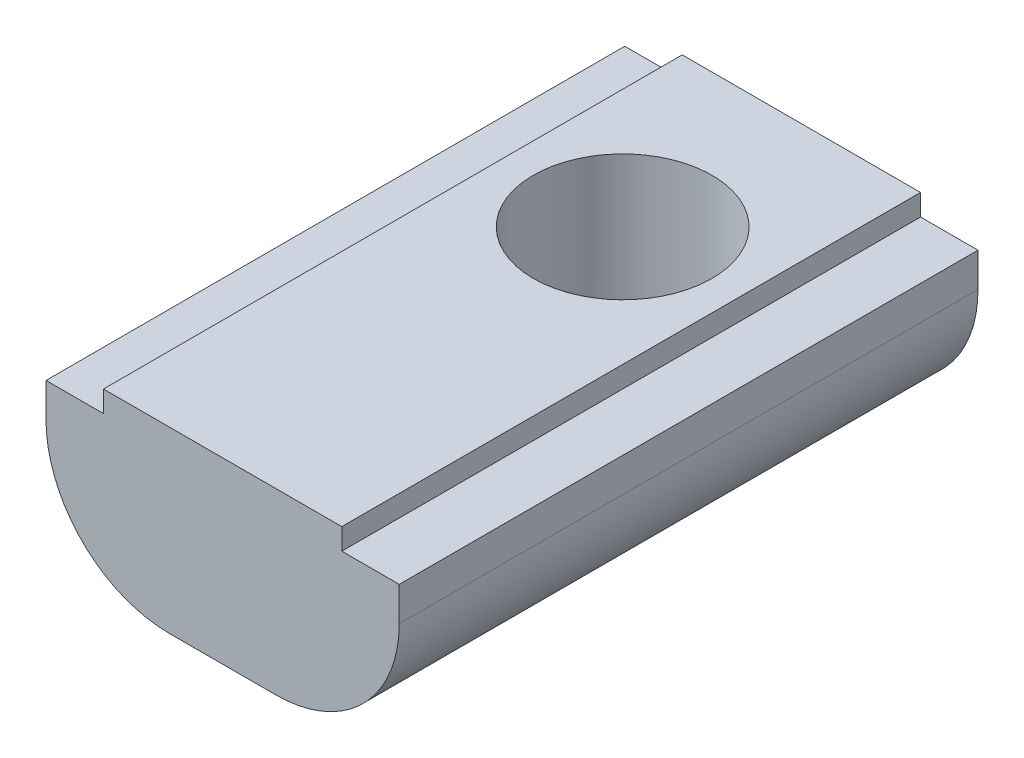
ISO-10303-21;
HEADER;
FILE_DESCRIPTION(('STEP AP214'),'2;1');
FILE_NAME('part.step','',(''),(''),'','','');
FILE_SCHEMA(('AUTOMOTIVE_DESIGN { 1 0 10303 214 1 1 1 1 }'));
ENDSEC;
DATA;
#1=APPLICATION_CONTEXT('core data for automotive mechanical design processes');
#2=APPLICATION_PROTOCOL_DEFINITION('international standard','automotive_design',2000,#1);
#3=PRODUCT_CONTEXT('',#1,'mechanical');
#4=PRODUCT('Part','Part','',(#3));
#5=PRODUCT_RELATED_PRODUCT_CATEGORY('part','',(#4));
#6=PRODUCT_DEFINITION_FORMATION('','',#4);
#7=PRODUCT_DEFINITION_CONTEXT('part definition',#1,'design');
#8=PRODUCT_DEFINITION('design','',#6,#7);
#9=PRODUCT_DEFINITION_SHAPE('','',#8);
#10=(LENGTH_UNIT() NAMED_UNIT(*) SI_UNIT(.MILLI.,.METRE.));
#11=(NAMED_UNIT(*) PLANE_ANGLE_UNIT() SI_UNIT($,.RADIAN.));
#12=(NAMED_UNIT(*) SI_UNIT($,.STERADIAN.) SOLID_ANGLE_UNIT());
#13=UNCERTAINTY_MEASURE_WITH_UNIT(LENGTH_MEASURE(1.E-05),#10,'distance_accuracy_value','');
#14=(GEOMETRIC_REPRESENTATION_CONTEXT(3) GLOBAL_UNCERTAINTY_ASSIGNED_CONTEXT((#13)) GLOBAL_UNIT_ASSIGNED_CONTEXT((#10,
#11,#12)) REPRESENTATION_CONTEXT('',''));
#15=CARTESIAN_POINT('',(0.,0.,0.));
#16=DIRECTION('',(0.,0.,1.));
#17=DIRECTION('',(1.,0.,0.));
#18=AXIS2_PLACEMENT_3D('',#15,#16,#17);
#19=CARTESIAN_POINT('',(1.25,-4.2,13.6));
#20=DIRECTION('',(0.,1.,0.));
#21=DIRECTION('',(0.,0.,1.));
#22=AXIS2_PLACEMENT_3D('',#19,#20,#21);
#23=PLANE('',#22);
#24=DIRECTION('',(0.,0.,-1.));
#25=VECTOR('',#24,1.);
#26=CARTESIAN_POINT('',(1.25,-4.2,13.6));
#27=LINE('',#26,#25);
#28=CARTESIAN_POINT('',(1.25,-4.2,2.51254629693139));
#29=VERTEX_POINT('',#28);
#30=CARTESIAN_POINT('',(1.25,-4.2,0.));
#31=VERTEX_POINT('',#30);
#32=EDGE_CURVE('E188',#29,#31,#27,.T.);
#33=ORIENTED_EDGE('',*,*,#32,.F.);
#34=CARTESIAN_POINT('',(0.,-4.2,4.2));
#35=DIRECTION('',(0.,1.,0.));
#36=DIRECTION('',(0.,0.,1.));
#37=AXIS2_PLACEMENT_3D('',#34,#35,#36);
#38=CIRCLE('',#37,2.1);
#39=CARTESIAN_POINT('',(-1.25,-4.2,2.51254629693138));
#40=VERTEX_POINT('',#39);
#41=EDGE_CURVE('E54',#29,#40,#38,.T.);
#42=ORIENTED_EDGE('',*,*,#41,.T.);
#43=DIRECTION('',(0.,0.,-1.));
#44=VECTOR('',#43,1.);
#45=CARTESIAN_POINT('',(-1.25,-4.2,13.6));
#46=LINE('',#45,#44);
#47=CARTESIAN_POINT('',(-1.25,-4.2,0.));
#48=VERTEX_POINT('',#47);
#49=EDGE_CURVE('E192',#40,#48,#46,.T.);
#50=ORIENTED_EDGE('',*,*,#49,.T.);
#51=DIRECTION('',(1.,0.,0.));
#52=VECTOR('',#51,1.);
#53=CARTESIAN_POINT('',(1.25,-4.2,0.));
#54=LINE('',#53,#52);
#55=EDGE_CURVE('E170',#48,#31,#54,.T.);
#56=ORIENTED_EDGE('',*,*,#55,.T.);
#57=EDGE_LOOP('',(#33,#42,#50,#56));
#58=FACE_BOUND('',#57,.T.);
#59=ADVANCED_FACE('F34',(#58),#23,.F.);
#60=CARTESIAN_POINT('',(-2.8,0.,13.6));
#61=DIRECTION('',(1.,0.,0.));
#62=DIRECTION('',(0.,0.,-1.));
#63=AXIS2_PLACEMENT_3D('',#60,#61,#62);
#64=PLANE('',#63);
#65=DIRECTION('',(0.,-1.,0.));
#66=VECTOR('',#65,1.);
#67=CARTESIAN_POINT('',(-2.8,0.,0.));
#68=LINE('',#67,#66);
#69=CARTESIAN_POINT('',(-2.8,0.,0.));
#70=VERTEX_POINT('',#69);
#71=CARTESIAN_POINT('',(-2.8,-0.500000000000001,0.));
#72=VERTEX_POINT('',#71);
#73=EDGE_CURVE('E159',#70,#72,#68,.T.);
#74=ORIENTED_EDGE('',*,*,#73,.T.);
#75=DIRECTION('',(0.,0.,-1.));
#76=VECTOR('',#75,1.);
#77=CARTESIAN_POINT('',(-2.8,-0.500000000000001,13.6));
#78=LINE('',#77,#76);
#79=CARTESIAN_POINT('',(-2.8,-0.500000000000001,13.6));
#80=VERTEX_POINT('',#79);
#81=EDGE_CURVE('E47',#80,#72,#78,.T.);
#82=ORIENTED_EDGE('',*,*,#81,.F.);
#83=DIRECTION('',(0.,-1.,0.));
#84=VECTOR('',#83,1.);
#85=CARTESIAN_POINT('',(-2.8,0.,13.6));
#86=LINE('',#85,#84);
#87=CARTESIAN_POINT('',(-2.8,0.,13.6));
#88=VERTEX_POINT('',#87);
#89=EDGE_CURVE('E181',#88,#80,#86,.T.);
#90=ORIENTED_EDGE('',*,*,#89,.F.);
#91=DIRECTION('',(0.,0.,-1.));
#92=VECTOR('',#91,1.);
#93=CARTESIAN_POINT('',(-2.8,0.,13.6));
#94=LINE('',#93,#92);
#95=EDGE_CURVE('E155',#88,#70,#94,.T.);
#96=ORIENTED_EDGE('',*,*,#95,.T.);
#97=EDGE_LOOP('',(#74,#82,#90,#96));
#98=FACE_BOUND('',#97,.T.);
#99=ADVANCED_FACE('F36',(#98),#64,.F.);
#100=CARTESIAN_POINT('',(-2.8,-0.500000000000001,13.6));
#101=DIRECTION('',(0.,-1.,0.));
#102=DIRECTION('',(1.,0.,0.));
#103=AXIS2_PLACEMENT_3D('',#100,#101,#102);
#104=PLANE('',#103);
#105=DIRECTION('',(-1.,0.,0.));
#106=VECTOR('',#105,1.);
#107=CARTESIAN_POINT('',(-2.8,-0.500000000000001,0.));
#108=LINE('',#107,#106);
#109=CARTESIAN_POINT('',(-4.15,-0.500000000000002,0.));
#110=VERTEX_POINT('',#109);
#111=EDGE_CURVE('E162',#72,#110,#108,.T.);
#112=ORIENTED_EDGE('',*,*,#111,.T.);
#113=DIRECTION('',(0.,0.,-1.));
#114=VECTOR('',#113,1.);
#115=CARTESIAN_POINT('',(-4.15,-0.500000000000002,13.6));
#116=LINE('',#115,#114);
#117=CARTESIAN_POINT('',(-4.15,-0.500000000000002,13.6));
#118=VERTEX_POINT('',#117);
#119=EDGE_CURVE('E199',#118,#110,#116,.T.);
#120=ORIENTED_EDGE('',*,*,#119,.F.);
#121=DIRECTION('',(-1.,0.,0.));
#122=VECTOR('',#121,1.);
#123=CARTESIAN_POINT('',(-2.8,-0.500000000000001,13.6));
#124=LINE('',#123,#122);
#125=EDGE_CURVE('E110',#80,#118,#124,.T.);
#126=ORIENTED_EDGE('',*,*,#125,.F.);
#127=ORIENTED_EDGE('',*,*,#81,.T.);
#128=EDGE_LOOP('',(#112,#120,#126,#127));
#129=FACE_BOUND('',#128,.T.);
#130=ADVANCED_FACE('F202',(#129),#104,.F.);
#131=CARTESIAN_POINT('',(-4.15,-0.500000000000002,13.6));
#132=DIRECTION('',(1.,0.,0.));
#133=DIRECTION('',(0.,1.,0.));
#134=AXIS2_PLACEMENT_3D('',#131,#132,#133);
#135=PLANE('',#134);
#136=DIRECTION('',(0.,-1.,0.));
#137=VECTOR('',#136,1.);
#138=CARTESIAN_POINT('',(-4.15,-0.500000000000002,0.));
#139=LINE('',#138,#137);
#140=CARTESIAN_POINT('',(-4.15,-1.3,0.));
#141=VERTEX_POINT('',#140);
#142=EDGE_CURVE('E165',#110,#141,#139,.T.);
#143=ORIENTED_EDGE('',*,*,#142,.T.);
#144=DIRECTION('',(0.,0.,-1.));
#145=VECTOR('',#144,1.);
#146=CARTESIAN_POINT('',(-4.15,-1.3,13.6));
#147=LINE('',#146,#145);
#148=CARTESIAN_POINT('',(-4.15,-1.3,13.6));
#149=VERTEX_POINT('',#148);
#150=EDGE_CURVE('E196',#149,#141,#147,.T.);
#151=ORIENTED_EDGE('',*,*,#150,.F.);
#152=DIRECTION('',(0.,-1.,0.));
#153=VECTOR('',#152,1.);
#154=CARTESIAN_POINT('',(-4.15,-0.500000000000002,13.6));
#155=LINE('',#154,#153);
#156=EDGE_CURVE('E224',#118,#149,#155,.T.);
#157=ORIENTED_EDGE('',*,*,#156,.F.);
#158=ORIENTED_EDGE('',*,*,#119,.T.);
#159=EDGE_LOOP('',(#143,#151,#157,#158));
#160=FACE_BOUND('',#159,.T.);
#161=ADVANCED_FACE('F213',(#160),#135,.F.);
#162=CARTESIAN_POINT('',(-1.25,-1.3,13.6));
#163=DIRECTION('',(0.,0.,-1.));
#164=DIRECTION('',(-1.,0.,0.));
#165=AXIS2_PLACEMENT_3D('',#162,#163,#164);
#166=CYLINDRICAL_SURFACE('',#165,2.9);
#167=ORIENTED_EDGE('',*,*,#49,.F.);
#168=CARTESIAN_POINT('',(-1.25,-4.2,2.51254629693139));
#169=CARTESIAN_POINT('',(-1.29679302358815,-4.20000162779569,2.54720613147119));
#170=CARTESIAN_POINT('',(-1.34210654962089,-4.19886739033813,2.58379078243395));
#171=CARTESIAN_POINT('',(-1.4294736763495,-4.19477086092717,2.66052497288662));
#172=CARTESIAN_POINT('',(-1.47152921453861,-4.19180966498832,2.70067236269233));
#173=CARTESIAN_POINT('',(-1.592248134523,-4.18086528521206,2.82589932642326));
#174=CARTESIAN_POINT('',(-1.66568861699531,-4.17081709738618,2.91593083823853));
#175=CARTESIAN_POINT('',(-1.79653736935906,-4.14880886083169,3.10646718108679));
#176=CARTESIAN_POINT('',(-1.85396894665814,-4.13685163182472,3.20695649052462));
#177=CARTESIAN_POINT('',(-1.95164145345667,-4.11428820760309,3.41615592729943));
#178=CARTESIAN_POINT('',(-1.99188016659913,-4.10368218669823,3.5248671124055));
#179=CARTESIAN_POINT('',(-2.05475080974325,-4.08630297770265,3.75050603803357));
#180=CARTESIAN_POINT('',(-2.07692477596599,-4.07963060370359,3.8675701892581));
#181=CARTESIAN_POINT('',(-2.10115925572021,-4.07230905515833,4.10392796490177));
#182=CARTESIAN_POINT('',(-2.10322722383182,-4.07165764825874,4.22322074658743));
#183=CARTESIAN_POINT('',(-2.08752919593551,-4.0764360699222,4.45531928550419));
#184=CARTESIAN_POINT('',(-2.07058949668459,-4.08161258036382,4.56818761625929));
#185=CARTESIAN_POINT('',(-2.01877355247524,-4.0963731756978,4.78947091338401));
#186=CARTESIAN_POINT('',(-1.98388735921023,-4.10595970489033,4.89788337369169));
#187=CARTESIAN_POINT('',(-1.89658041100682,-4.1273615966629,5.10896845544056));
#188=CARTESIAN_POINT('',(-1.8439163503699,-4.13920683519873,5.21153699074508));
#189=CARTESIAN_POINT('',(-1.72251496587779,-4.161909220898,5.40669827924429));
#190=CARTESIAN_POINT('',(-1.65379590412449,-4.17276747138328,5.49930219339976));
#191=CARTESIAN_POINT('',(-1.52885656363337,-4.18698274872469,5.64156955318508));
#192=CARTESIAN_POINT('',(-1.47682649154659,-4.19163447976084,5.69482718365556));
#193=CARTESIAN_POINT('',(-1.36734216390807,-4.19814513030808,5.79559425268969));
#194=CARTESIAN_POINT('',(-1.30988916461216,-4.20000469496297,5.84310501676177));
#195=CARTESIAN_POINT('',(-1.25,-4.2,5.88745370306861));
#196=B_SPLINE_CURVE_WITH_KNOTS('',3,(#168,#169,#170,#171,#172,#173,#174,#175,#176,#177,#178,
#179,#180,#181,#182,#183,#184,#185,#186,#187,#188,#189,#190,#191,#192,#193,#194,#195),
.UNSPECIFIED.,.F.,.F.,(4,2,2,2,2,2,2,2,2,2,2,2,2,4),(0.,0.174556159947332,0.349007703224587,
0.69708176058304,1.0446463771914,1.39225578534907,1.74842501068925,2.10446217626738,
2.44560159052293,2.78693031319363,3.1331337485854,3.47894528846722,3.70230915212592,
3.92562139851794),.UNSPECIFIED.);
#197=CARTESIAN_POINT('',(-1.25,-4.2,5.88745370306862));
#198=VERTEX_POINT('',#197);
#199=EDGE_CURVE('E163',#40,#198,#196,.T.);
#200=ORIENTED_EDGE('',*,*,#199,.T.);
#201=CARTESIAN_POINT('',(-1.25,-4.2,13.6));
#202=VERTEX_POINT('',#201);
#203=EDGE_CURVE('E193',#202,#198,#46,.T.);
#204=ORIENTED_EDGE('',*,*,#203,.F.);
#205=CARTESIAN_POINT('',(-1.25,-1.3,13.6));
#206=DIRECTION('',(0.,0.,1.));
#207=DIRECTION('',(-1.,0.,0.));
#208=AXIS2_PLACEMENT_3D('',#205,#206,#207);
#209=CIRCLE('',#208,2.9);
#210=EDGE_CURVE('E220',#149,#202,#209,.T.);
#211=ORIENTED_EDGE('',*,*,#210,.F.);
#212=ORIENTED_EDGE('',*,*,#150,.T.);
#213=CARTESIAN_POINT('',(-1.25,-1.3,0.));
#214=DIRECTION('',(0.,0.,1.));
#215=DIRECTION('',(-1.,0.,0.));
#216=AXIS2_PLACEMENT_3D('',#213,#214,#215);
#217=CIRCLE('',#216,2.9);
#218=EDGE_CURVE('E167',#141,#48,#217,.T.);
#219=ORIENTED_EDGE('',*,*,#218,.T.);
#220=EDGE_LOOP('',(#167,#200,#204,#211,#212,#219));
#221=FACE_BOUND('',#220,.T.);
#222=ADVANCED_FACE('F218',(#221),#166,.T.);
#223=ORIENTED_EDGE('',*,*,#203,.T.);
#224=CARTESIAN_POINT('',(1.25,-4.2,5.88745370306862));
#225=VERTEX_POINT('',#224);
#226=EDGE_CURVE('E248',#198,#225,#38,.T.);
#227=ORIENTED_EDGE('',*,*,#226,.T.);
#228=CARTESIAN_POINT('',(1.25,-4.2,13.6));
#229=VERTEX_POINT('',#228);
#230=EDGE_CURVE('E189',#229,#225,#27,.T.);
#231=ORIENTED_EDGE('',*,*,#230,.F.);
#232=DIRECTION('',(1.,0.,0.));
#233=VECTOR('',#232,1.);
#234=CARTESIAN_POINT('',(1.25,-4.2,13.6));
#235=LINE('',#234,#233);
#236=EDGE_CURVE('E223',#202,#229,#235,.T.);
#237=ORIENTED_EDGE('',*,*,#236,.F.);
#238=EDGE_LOOP('',(#223,#227,#231,#237));
#239=FACE_BOUND('',#238,.T.);
#240=ADVANCED_FACE('F273',(#239),#23,.F.);
#241=CARTESIAN_POINT('',(1.25,-1.3,13.6));
#242=DIRECTION('',(0.,0.,-1.));
#243=DIRECTION('',(-1.,0.,0.));
#244=AXIS2_PLACEMENT_3D('',#241,#242,#243);
#245=CYLINDRICAL_SURFACE('',#244,2.9);
#246=ORIENTED_EDGE('',*,*,#230,.T.);
#247=CARTESIAN_POINT('',(1.25,-4.2,5.88745370306861));
#248=CARTESIAN_POINT('',(1.29679302358816,-4.20000162779569,5.85279386852881));
#249=CARTESIAN_POINT('',(1.34210654962089,-4.19886739033813,5.81620921756605));
#250=CARTESIAN_POINT('',(1.4294736763495,-4.19477086092717,5.73947502711338));
#251=CARTESIAN_POINT('',(1.47152921453861,-4.19180966498832,5.69932763730767));
#252=CARTESIAN_POINT('',(1.592248134523,-4.18086528521206,5.57410067357674));
#253=CARTESIAN_POINT('',(1.66568861699531,-4.17081709738618,5.48406916176148));
#254=CARTESIAN_POINT('',(1.79653736935906,-4.14880886083169,5.29353281891321));
#255=CARTESIAN_POINT('',(1.85396894665814,-4.13685163182472,5.19304350947538));
#256=CARTESIAN_POINT('',(1.95164145345667,-4.11428820760309,4.98384407270057));
#257=CARTESIAN_POINT('',(1.99188016659913,-4.10368218669823,4.8751328875945));
#258=CARTESIAN_POINT('',(2.05475080974325,-4.08630297770265,4.64949396196644));
#259=CARTESIAN_POINT('',(2.07692477596599,-4.07963060370359,4.5324298107419));
#260=CARTESIAN_POINT('',(2.10115925572021,-4.07230905515833,4.29607203509823));
#261=CARTESIAN_POINT('',(2.10322722383183,-4.07165764825874,4.17677925341258));
#262=CARTESIAN_POINT('',(2.08752919593551,-4.0764360699222,3.94468071449581));
#263=CARTESIAN_POINT('',(2.0705894966846,-4.08161258036382,3.83181238374071));
#264=CARTESIAN_POINT('',(2.01877355247524,-4.0963731756978,3.610529086616));
#265=CARTESIAN_POINT('',(1.98388735921023,-4.10595970489033,3.50211662630831));
#266=CARTESIAN_POINT('',(1.89658041100682,-4.1273615966629,3.29103154455944));
#267=CARTESIAN_POINT('',(1.8439163503699,-4.13920683519873,3.18846300925493));
#268=CARTESIAN_POINT('',(1.72251496587779,-4.161909220898,2.99330172075571));
#269=CARTESIAN_POINT('',(1.65379590412449,-4.17276747138328,2.90069780660024));
#270=CARTESIAN_POINT('',(1.52885656363337,-4.18698274872469,2.75843044681492));
#271=CARTESIAN_POINT('',(1.47682649154659,-4.19163447976084,2.70517281634444));
#272=CARTESIAN_POINT('',(1.36734216390807,-4.19814513030808,2.60440574731031));
#273=CARTESIAN_POINT('',(1.30988916461216,-4.20000469496297,2.55689498323824));
#274=CARTESIAN_POINT('',(1.25,-4.2,2.51254629693139));
#275=B_SPLINE_CURVE_WITH_KNOTS('',3,(#247,#248,#249,#250,#251,#252,#253,#254,#255,#256,#257,
#258,#259,#260,#261,#262,#263,#264,#265,#266,#267,#268,#269,#270,#271,#272,#273,#274),
.UNSPECIFIED.,.F.,.F.,(4,2,2,2,2,2,2,2,2,2,2,2,2,4),(0.,0.174556159947332,0.349007703224586,
0.697081760583039,1.0446463771914,1.39225578534907,1.74842501068925,2.10446217626738,
2.44560159052293,2.78693031319363,3.1331337485854,3.47894528846721,3.70230915212592,
3.92562139851794),.UNSPECIFIED.);
#276=EDGE_CURVE('E11',#225,#29,#275,.T.);
#277=ORIENTED_EDGE('',*,*,#276,.T.);
#278=ORIENTED_EDGE('',*,*,#32,.T.);
#279=CARTESIAN_POINT('',(1.25,-1.3,0.));
#280=DIRECTION('',(0.,0.,1.));
#281=DIRECTION('',(1.,0.,0.));
#282=AXIS2_PLACEMENT_3D('',#279,#280,#281);
#283=CIRCLE('',#282,2.9);
#284=CARTESIAN_POINT('',(4.15,-1.3,0.));
#285=VERTEX_POINT('',#284);
#286=EDGE_CURVE('E173',#31,#285,#283,.T.);
#287=ORIENTED_EDGE('',*,*,#286,.T.);
#288=DIRECTION('',(0.,0.,-1.));
#289=VECTOR('',#288,1.);
#290=CARTESIAN_POINT('',(4.15,-1.3,13.6));
#291=LINE('',#290,#289);
#292=CARTESIAN_POINT('',(4.15,-1.3,13.6));
#293=VERTEX_POINT('',#292);
#294=EDGE_CURVE('E185',#293,#285,#291,.T.);
#295=ORIENTED_EDGE('',*,*,#294,.F.);
#296=CARTESIAN_POINT('',(1.25,-1.3,13.6));
#297=DIRECTION('',(0.,0.,1.));
#298=DIRECTION('',(1.,0.,0.));
#299=AXIS2_PLACEMENT_3D('',#296,#297,#298);
#300=CIRCLE('',#299,2.9);
#301=EDGE_CURVE('E226',#229,#293,#300,.T.);
#302=ORIENTED_EDGE('',*,*,#301,.F.);
#303=EDGE_LOOP('',(#246,#277,#278,#287,#295,#302));
#304=FACE_BOUND('',#303,.T.);
#305=ADVANCED_FACE('F235',(#304),#245,.T.);
#306=CARTESIAN_POINT('',(4.15,-0.500000000000002,13.6));
#307=DIRECTION('',(-1.,0.,0.));
#308=DIRECTION('',(0.,-1.,0.));
#309=AXIS2_PLACEMENT_3D('',#306,#307,#308);
#310=PLANE('',#309);
#311=DIRECTION('',(0.,1.,0.));
#312=VECTOR('',#311,1.);
#313=CARTESIAN_POINT('',(4.15,-0.500000000000002,0.));
#314=LINE('',#313,#312);
#315=CARTESIAN_POINT('',(4.15,-0.500000000000002,0.));
#316=VERTEX_POINT('',#315);
#317=EDGE_CURVE('E175',#285,#316,#314,.T.);
#318=ORIENTED_EDGE('',*,*,#317,.T.);
#319=DIRECTION('',(0.,0.,-1.));
#320=VECTOR('',#319,1.);
#321=CARTESIAN_POINT('',(4.15,-0.500000000000002,13.6));
#322=LINE('',#321,#320);
#323=CARTESIAN_POINT('',(4.15,-0.500000000000002,13.6));
#324=VERTEX_POINT('',#323);
#325=EDGE_CURVE('E150',#324,#316,#322,.T.);
#326=ORIENTED_EDGE('',*,*,#325,.F.);
#327=DIRECTION('',(0.,1.,0.));
#328=VECTOR('',#327,1.);
#329=CARTESIAN_POINT('',(4.15,-0.500000000000002,13.6));
#330=LINE('',#329,#328);
#331=EDGE_CURVE('E138',#293,#324,#330,.T.);
#332=ORIENTED_EDGE('',*,*,#331,.F.);
#333=ORIENTED_EDGE('',*,*,#294,.T.);
#334=EDGE_LOOP('',(#318,#326,#332,#333));
#335=FACE_BOUND('',#334,.T.);
#336=ADVANCED_FACE('F239',(#335),#310,.F.);
#337=CARTESIAN_POINT('',(2.8,-0.500000000000001,13.6));
#338=DIRECTION('',(0.,-1.,0.));
#339=DIRECTION('',(1.,0.,0.));
#340=AXIS2_PLACEMENT_3D('',#337,#338,#339);
#341=PLANE('',#340);
#342=DIRECTION('',(-1.,0.,0.));
#343=VECTOR('',#342,1.);
#344=CARTESIAN_POINT('',(2.8,-0.500000000000001,0.));
#345=LINE('',#344,#343);
#346=CARTESIAN_POINT('',(2.8,-0.500000000000001,0.));
#347=VERTEX_POINT('',#346);
#348=EDGE_CURVE('E147',#316,#347,#345,.T.);
#349=ORIENTED_EDGE('',*,*,#348,.T.);
#350=DIRECTION('',(0.,0.,-1.));
#351=VECTOR('',#350,1.);
#352=CARTESIAN_POINT('',(2.8,-0.500000000000001,13.6));
#353=LINE('',#352,#351);
#354=CARTESIAN_POINT('',(2.8,-0.500000000000001,13.6));
#355=VERTEX_POINT('',#354);
#356=EDGE_CURVE('E144',#355,#347,#353,.T.);
#357=ORIENTED_EDGE('',*,*,#356,.F.);
#358=DIRECTION('',(-1.,0.,0.));
#359=VECTOR('',#358,1.);
#360=CARTESIAN_POINT('',(2.8,-0.500000000000001,13.6));
#361=LINE('',#360,#359);
#362=EDGE_CURVE('E131',#324,#355,#361,.T.);
#363=ORIENTED_EDGE('',*,*,#362,.F.);
#364=ORIENTED_EDGE('',*,*,#325,.T.);
#365=EDGE_LOOP('',(#349,#357,#363,#364));
#366=FACE_BOUND('',#365,.T.);
#367=ADVANCED_FACE('F145',(#366),#341,.F.);
#368=CARTESIAN_POINT('',(2.8,0.,13.6));
#369=DIRECTION('',(-1.,0.,0.));
#370=DIRECTION('',(0.,0.,1.));
#371=AXIS2_PLACEMENT_3D('',#368,#369,#370);
#372=PLANE('',#371);
#373=DIRECTION('',(0.,1.,0.));
#374=VECTOR('',#373,1.);
#375=CARTESIAN_POINT('',(2.8,0.,0.));
#376=LINE('',#375,#374);
#377=CARTESIAN_POINT('',(2.8,0.,0.));
#378=VERTEX_POINT('',#377);
#379=EDGE_CURVE('E178',#347,#378,#376,.T.);
#380=ORIENTED_EDGE('',*,*,#379,.T.);
#381=DIRECTION('',(0.,0.,-1.));
#382=VECTOR('',#381,1.);
#383=CARTESIAN_POINT('',(2.8,0.,13.6));
#384=LINE('',#383,#382);
#385=CARTESIAN_POINT('',(2.8,0.,13.6));
#386=VERTEX_POINT('',#385);
#387=EDGE_CURVE('E151',#386,#378,#384,.T.);
#388=ORIENTED_EDGE('',*,*,#387,.F.);
#389=DIRECTION('',(0.,1.,0.));
#390=VECTOR('',#389,1.);
#391=CARTESIAN_POINT('',(2.8,0.,13.6));
#392=LINE('',#391,#390);
#393=EDGE_CURVE('E135',#355,#386,#392,.T.);
#394=ORIENTED_EDGE('',*,*,#393,.F.);
#395=ORIENTED_EDGE('',*,*,#356,.T.);
#396=EDGE_LOOP('',(#380,#388,#394,#395));
#397=FACE_BOUND('',#396,.T.);
#398=ADVANCED_FACE('F153',(#397),#372,.F.);
#399=CARTESIAN_POINT('',(2.8,0.,13.6));
#400=DIRECTION('',(0.,-1.,0.));
#401=DIRECTION('',(0.,0.,-1.));
#402=AXIS2_PLACEMENT_3D('',#399,#400,#401);
#403=PLANE('',#402);
#404=CARTESIAN_POINT('',(0.,0.,4.2));
#405=DIRECTION('',(0.,1.,0.));
#406=DIRECTION('',(0.,0.,1.));
#407=AXIS2_PLACEMENT_3D('',#404,#405,#406);
#408=CIRCLE('',#407,2.09999999999999);
#409=CARTESIAN_POINT('',(0.,0.,6.29999999999999));
#410=VERTEX_POINT('',#409);
#411=EDGE_CURVE('E290',#410,#410,#408,.T.);
#412=ORIENTED_EDGE('',*,*,#411,.F.);
#413=EDGE_LOOP('',(#412));
#414=FACE_BOUND('',#413,.T.);
#415=DIRECTION('',(-1.,0.,0.));
#416=VECTOR('',#415,1.);
#417=CARTESIAN_POINT('',(2.8,0.,0.));
#418=LINE('',#417,#416);
#419=EDGE_CURVE('E101',#378,#70,#418,.T.);
#420=ORIENTED_EDGE('',*,*,#419,.T.);
#421=ORIENTED_EDGE('',*,*,#95,.F.);
#422=DIRECTION('',(-1.,0.,0.));
#423=VECTOR('',#422,1.);
#424=CARTESIAN_POINT('',(2.8,0.,13.6));
#425=LINE('',#424,#423);
#426=EDGE_CURVE('E62',#386,#88,#425,.T.);
#427=ORIENTED_EDGE('',*,*,#426,.F.);
#428=ORIENTED_EDGE('',*,*,#387,.T.);
#429=EDGE_LOOP('',(#420,#421,#427,#428));
#430=FACE_BOUND('',#429,.T.);
#431=ADVANCED_FACE('F240',(#414,#430),#403,.F.);
#432=CARTESIAN_POINT('',(-1.25,-1.3,13.6));
#433=DIRECTION('',(0.,0.,-1.));
#434=DIRECTION('',(-1.,0.,0.));
#435=AXIS2_PLACEMENT_3D('',#432,#433,#434);
#436=PLANE('',#435);
#437=ORIENTED_EDGE('',*,*,#89,.T.);
#438=ORIENTED_EDGE('',*,*,#125,.T.);
#439=ORIENTED_EDGE('',*,*,#156,.T.);
#440=ORIENTED_EDGE('',*,*,#210,.T.);
#441=ORIENTED_EDGE('',*,*,#236,.T.);
#442=ORIENTED_EDGE('',*,*,#301,.T.);
#443=ORIENTED_EDGE('',*,*,#331,.T.);
#444=ORIENTED_EDGE('',*,*,#362,.T.);
#445=ORIENTED_EDGE('',*,*,#393,.T.);
#446=ORIENTED_EDGE('',*,*,#426,.T.);
#447=EDGE_LOOP('',(#437,#438,#439,#440,#441,#442,#443,#444,#445,#446));
#448=FACE_BOUND('',#447,.T.);
#449=ADVANCED_FACE('F133',(#448),#436,.F.);
#450=CARTESIAN_POINT('',(-1.25,-1.3,0.));
#451=DIRECTION('',(0.,0.,-1.));
#452=DIRECTION('',(-1.,0.,0.));
#453=AXIS2_PLACEMENT_3D('',#450,#451,#452);
#454=PLANE('',#453);
#455=ORIENTED_EDGE('',*,*,#73,.F.);
#456=ORIENTED_EDGE('',*,*,#419,.F.);
#457=ORIENTED_EDGE('',*,*,#379,.F.);
#458=ORIENTED_EDGE('',*,*,#348,.F.);
#459=ORIENTED_EDGE('',*,*,#317,.F.);
#460=ORIENTED_EDGE('',*,*,#286,.F.);
#461=ORIENTED_EDGE('',*,*,#55,.F.);
#462=ORIENTED_EDGE('',*,*,#218,.F.);
#463=ORIENTED_EDGE('',*,*,#142,.F.);
#464=ORIENTED_EDGE('',*,*,#111,.F.);
#465=EDGE_LOOP('',(#455,#456,#457,#458,#459,#460,#461,#462,#463,#464));
#466=FACE_BOUND('',#465,.T.);
#467=ADVANCED_FACE('F207',(#466),#454,.T.);
#468=CARTESIAN_POINT('',(0.,0.,4.2));
#469=DIRECTION('',(0.,1.,0.));
#470=DIRECTION('',(0.,0.,1.));
#471=AXIS2_PLACEMENT_3D('',#468,#469,#470);
#472=CYLINDRICAL_SURFACE('',#471,2.09999999999999);
#473=ORIENTED_EDGE('',*,*,#411,.T.);
#474=EDGE_LOOP('',(#473));
#475=FACE_BOUND('',#474,.T.);
#476=ORIENTED_EDGE('',*,*,#41,.F.);
#477=ORIENTED_EDGE('',*,*,#276,.F.);
#478=ORIENTED_EDGE('',*,*,#226,.F.);
#479=ORIENTED_EDGE('',*,*,#199,.F.);
#480=EDGE_LOOP('',(#476,#477,#478,#479));
#481=FACE_BOUND('',#480,.T.);
#482=ADVANCED_FACE('F253',(#475,#481),#472,.F.);
#483=CLOSED_SHELL('',(#59,#99,#130,#161,#222,#240,#305,#336,#367,#398,#431,#449,#467,#482));
#484=MANIFOLD_SOLID_BREP('B2',#483);
#485=ADVANCED_BREP_SHAPE_REPRESENTATION('',(#18,#484),#14);
#486=SHAPE_DEFINITION_REPRESENTATION(#9,#485);
ENDSEC;
END-ISO-10303-21;
